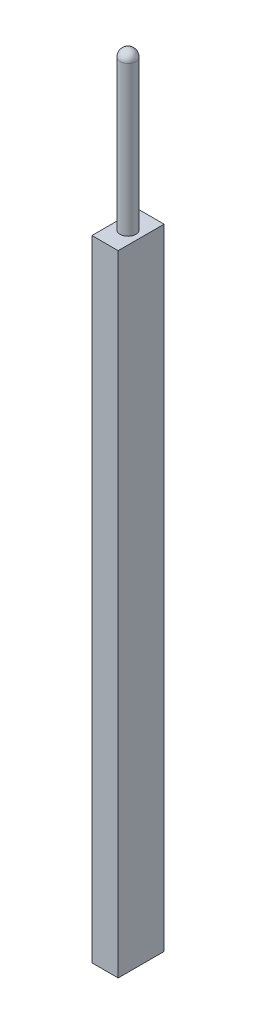
ISO-10303-21;
HEADER;
FILE_DESCRIPTION(('STEP AP214'),'2;1');
FILE_NAME('part.step','',(''),(''),'','','');
FILE_SCHEMA(('AUTOMOTIVE_DESIGN { 1 0 10303 214 1 1 1 1 }'));
ENDSEC;
DATA;
#1=APPLICATION_CONTEXT('core data for automotive mechanical design processes');
#2=APPLICATION_PROTOCOL_DEFINITION('international standard','automotive_design',2000,#1);
#3=PRODUCT_CONTEXT('',#1,'mechanical');
#4=PRODUCT('Part','Part','',(#3));
#5=PRODUCT_RELATED_PRODUCT_CATEGORY('part','',(#4));
#6=PRODUCT_DEFINITION_FORMATION('','',#4);
#7=PRODUCT_DEFINITION_CONTEXT('part definition',#1,'design');
#8=PRODUCT_DEFINITION('design','',#6,#7);
#9=PRODUCT_DEFINITION_SHAPE('','',#8);
#10=(LENGTH_UNIT() NAMED_UNIT(*) SI_UNIT(.MILLI.,.METRE.));
#11=(NAMED_UNIT(*) PLANE_ANGLE_UNIT() SI_UNIT($,.RADIAN.));
#12=(NAMED_UNIT(*) SI_UNIT($,.STERADIAN.) SOLID_ANGLE_UNIT());
#13=UNCERTAINTY_MEASURE_WITH_UNIT(LENGTH_MEASURE(1.E-05),#10,'distance_accuracy_value','');
#14=(GEOMETRIC_REPRESENTATION_CONTEXT(3) GLOBAL_UNCERTAINTY_ASSIGNED_CONTEXT((#13)) GLOBAL_UNIT_ASSIGNED_CONTEXT((#10,
#11,#12)) REPRESENTATION_CONTEXT('',''));
#15=CARTESIAN_POINT('',(0.,0.,0.));
#16=DIRECTION('',(0.,0.,1.));
#17=DIRECTION('',(1.,0.,0.));
#18=AXIS2_PLACEMENT_3D('',#15,#16,#17);
#19=CARTESIAN_POINT('',(0.,28.5,0.));
#20=DIRECTION('',(0.,-1.,0.));
#21=DIRECTION('',(1.,0.,0.));
#22=AXIS2_PLACEMENT_3D('',#19,#20,#21);
#23=SPHERICAL_SURFACE('',#22,1.5);
#24=CARTESIAN_POINT('',(0.,28.5,0.));
#25=DIRECTION('',(0.,-1.,0.));
#26=DIRECTION('',(0.,0.,-1.));
#27=AXIS2_PLACEMENT_3D('',#24,#25,#26);
#28=CIRCLE('',#27,1.5);
#29=CARTESIAN_POINT('',(0.,28.5,-1.5));
#30=VERTEX_POINT('',#29);
#31=EDGE_CURVE('E11',#30,#30,#28,.T.);
#32=ORIENTED_EDGE('',*,*,#31,.F.);
#33=EDGE_LOOP('',(#32));
#34=FACE_BOUND('',#33,.T.);
#35=ADVANCED_FACE('F39',(#34),#23,.T.);
#36=CARTESIAN_POINT('',(0.,0.,0.));
#37=DIRECTION('',(0.,-1.,0.));
#38=DIRECTION('',(0.,0.,-1.));
#39=AXIS2_PLACEMENT_3D('',#36,#37,#38);
#40=CYLINDRICAL_SURFACE('',#39,1.5);
#41=CARTESIAN_POINT('',(0.,0.,0.));
#42=DIRECTION('',(0.,-1.,0.));
#43=DIRECTION('',(0.,0.,-1.));
#44=AXIS2_PLACEMENT_3D('',#41,#42,#43);
#45=CIRCLE('',#44,1.5);
#46=CARTESIAN_POINT('',(0.,0.,-1.5));
#47=VERTEX_POINT('',#46);
#48=EDGE_CURVE('E47',#47,#47,#45,.T.);
#49=ORIENTED_EDGE('',*,*,#48,.F.);
#50=EDGE_LOOP('',(#49));
#51=FACE_BOUND('',#50,.T.);
#52=ORIENTED_EDGE('',*,*,#31,.T.);
#53=EDGE_LOOP('',(#52));
#54=FACE_BOUND('',#53,.T.);
#55=ADVANCED_FACE('F120',(#51,#54),#40,.T.);
#56=CARTESIAN_POINT('',(2.5,-120.,-4.375));
#57=DIRECTION('',(-1.,0.,0.));
#58=DIRECTION('',(0.,0.,1.));
#59=AXIS2_PLACEMENT_3D('',#56,#57,#58);
#60=PLANE('',#59);
#61=DIRECTION('',(0.,0.,1.));
#62=VECTOR('',#61,1.);
#63=CARTESIAN_POINT('',(2.5,0.,-4.375));
#64=LINE('',#63,#62);
#65=CARTESIAN_POINT('',(2.5,0.,-4.375));
#66=VERTEX_POINT('',#65);
#67=CARTESIAN_POINT('',(2.5,0.,4.375));
#68=VERTEX_POINT('',#67);
#69=EDGE_CURVE('E106',#66,#68,#64,.T.);
#70=ORIENTED_EDGE('',*,*,#69,.T.);
#71=DIRECTION('',(0.,1.,0.));
#72=VECTOR('',#71,1.);
#73=CARTESIAN_POINT('',(2.5,-120.,4.375));
#74=LINE('',#73,#72);
#75=CARTESIAN_POINT('',(2.5,-120.,4.375));
#76=VERTEX_POINT('',#75);
#77=EDGE_CURVE('E97',#76,#68,#74,.T.);
#78=ORIENTED_EDGE('',*,*,#77,.F.);
#79=DIRECTION('',(0.,0.,1.));
#80=VECTOR('',#79,1.);
#81=CARTESIAN_POINT('',(2.5,-120.,-4.375));
#82=LINE('',#81,#80);
#83=CARTESIAN_POINT('',(2.5,-120.,-4.375));
#84=VERTEX_POINT('',#83);
#85=EDGE_CURVE('E91',#84,#76,#82,.T.);
#86=ORIENTED_EDGE('',*,*,#85,.F.);
#87=DIRECTION('',(0.,1.,0.));
#88=VECTOR('',#87,1.);
#89=CARTESIAN_POINT('',(2.5,-120.,-4.375));
#90=LINE('',#89,#88);
#91=EDGE_CURVE('E102',#84,#66,#90,.T.);
#92=ORIENTED_EDGE('',*,*,#91,.T.);
#93=EDGE_LOOP('',(#70,#78,#86,#92));
#94=FACE_BOUND('',#93,.T.);
#95=ADVANCED_FACE('F123',(#94),#60,.F.);
#96=CARTESIAN_POINT('',(-2.5,-120.,4.375));
#97=DIRECTION('',(0.,0.,-1.));
#98=DIRECTION('',(-1.,0.,0.));
#99=AXIS2_PLACEMENT_3D('',#96,#97,#98);
#100=PLANE('',#99);
#101=DIRECTION('',(-1.,0.,0.));
#102=VECTOR('',#101,1.);
#103=CARTESIAN_POINT('',(-2.5,0.,4.375));
#104=LINE('',#103,#102);
#105=CARTESIAN_POINT('',(-2.5,0.,4.375));
#106=VERTEX_POINT('',#105);
#107=EDGE_CURVE('E96',#68,#106,#104,.T.);
#108=ORIENTED_EDGE('',*,*,#107,.T.);
#109=DIRECTION('',(0.,1.,0.));
#110=VECTOR('',#109,1.);
#111=CARTESIAN_POINT('',(-2.5,-120.,4.375));
#112=LINE('',#111,#110);
#113=CARTESIAN_POINT('',(-2.5,-120.,4.375));
#114=VERTEX_POINT('',#113);
#115=EDGE_CURVE('E94',#114,#106,#112,.T.);
#116=ORIENTED_EDGE('',*,*,#115,.F.);
#117=DIRECTION('',(-1.,0.,0.));
#118=VECTOR('',#117,1.);
#119=CARTESIAN_POINT('',(-2.5,-120.,4.375));
#120=LINE('',#119,#118);
#121=EDGE_CURVE('E86',#76,#114,#120,.T.);
#122=ORIENTED_EDGE('',*,*,#121,.F.);
#123=ORIENTED_EDGE('',*,*,#77,.T.);
#124=EDGE_LOOP('',(#108,#116,#122,#123));
#125=FACE_BOUND('',#124,.T.);
#126=ADVANCED_FACE('F95',(#125),#100,.F.);
#127=CARTESIAN_POINT('',(-2.5,-120.,-4.375));
#128=DIRECTION('',(1.,0.,0.));
#129=DIRECTION('',(0.,0.,-1.));
#130=AXIS2_PLACEMENT_3D('',#127,#128,#129);
#131=PLANE('',#130);
#132=DIRECTION('',(0.,0.,-1.));
#133=VECTOR('',#132,1.);
#134=CARTESIAN_POINT('',(-2.5,0.,-4.375));
#135=LINE('',#134,#133);
#136=CARTESIAN_POINT('',(-2.5,0.,-4.375));
#137=VERTEX_POINT('',#136);
#138=EDGE_CURVE('E72',#106,#137,#135,.T.);
#139=ORIENTED_EDGE('',*,*,#138,.T.);
#140=DIRECTION('',(0.,1.,0.));
#141=VECTOR('',#140,1.);
#142=CARTESIAN_POINT('',(-2.5,-120.,-4.375));
#143=LINE('',#142,#141);
#144=CARTESIAN_POINT('',(-2.5,-120.,-4.375));
#145=VERTEX_POINT('',#144);
#146=EDGE_CURVE('E98',#145,#137,#143,.T.);
#147=ORIENTED_EDGE('',*,*,#146,.F.);
#148=DIRECTION('',(0.,0.,-1.));
#149=VECTOR('',#148,1.);
#150=CARTESIAN_POINT('',(-2.5,-120.,-4.375));
#151=LINE('',#150,#149);
#152=EDGE_CURVE('E89',#114,#145,#151,.T.);
#153=ORIENTED_EDGE('',*,*,#152,.F.);
#154=ORIENTED_EDGE('',*,*,#115,.T.);
#155=EDGE_LOOP('',(#139,#147,#153,#154));
#156=FACE_BOUND('',#155,.T.);
#157=ADVANCED_FACE('F100',(#156),#131,.F.);
#158=CARTESIAN_POINT('',(-2.5,-120.,-4.375));
#159=DIRECTION('',(0.,0.,1.));
#160=DIRECTION('',(1.,0.,0.));
#161=AXIS2_PLACEMENT_3D('',#158,#159,#160);
#162=PLANE('',#161);
#163=DIRECTION('',(1.,0.,0.));
#164=VECTOR('',#163,1.);
#165=CARTESIAN_POINT('',(-2.5,0.,-4.375));
#166=LINE('',#165,#164);
#167=EDGE_CURVE('E78',#137,#66,#166,.T.);
#168=ORIENTED_EDGE('',*,*,#167,.T.);
#169=ORIENTED_EDGE('',*,*,#91,.F.);
#170=DIRECTION('',(1.,0.,0.));
#171=VECTOR('',#170,1.);
#172=CARTESIAN_POINT('',(-2.5,-120.,-4.375));
#173=LINE('',#172,#171);
#174=EDGE_CURVE('E55',#145,#84,#173,.T.);
#175=ORIENTED_EDGE('',*,*,#174,.F.);
#176=ORIENTED_EDGE('',*,*,#146,.T.);
#177=EDGE_LOOP('',(#168,#169,#175,#176));
#178=FACE_BOUND('',#177,.T.);
#179=ADVANCED_FACE('F154',(#178),#162,.F.);
#180=CARTESIAN_POINT('',(0.,-120.,0.));
#181=DIRECTION('',(0.,1.,0.));
#182=DIRECTION('',(0.,0.,1.));
#183=AXIS2_PLACEMENT_3D('',#180,#181,#182);
#184=PLANE('',#183);
#185=ORIENTED_EDGE('',*,*,#85,.T.);
#186=ORIENTED_EDGE('',*,*,#121,.T.);
#187=ORIENTED_EDGE('',*,*,#152,.T.);
#188=ORIENTED_EDGE('',*,*,#174,.T.);
#189=EDGE_LOOP('',(#185,#186,#187,#188));
#190=FACE_BOUND('',#189,.T.);
#191=ADVANCED_FACE('F87',(#190),#184,.F.);
#192=CARTESIAN_POINT('',(0.,0.,0.));
#193=DIRECTION('',(0.,1.,0.));
#194=DIRECTION('',(0.,0.,1.));
#195=AXIS2_PLACEMENT_3D('',#192,#193,#194);
#196=PLANE('',#195);
#197=ORIENTED_EDGE('',*,*,#48,.T.);
#198=EDGE_LOOP('',(#197));
#199=FACE_BOUND('',#198,.T.);
#200=ORIENTED_EDGE('',*,*,#69,.F.);
#201=ORIENTED_EDGE('',*,*,#167,.F.);
#202=ORIENTED_EDGE('',*,*,#138,.F.);
#203=ORIENTED_EDGE('',*,*,#107,.F.);
#204=EDGE_LOOP('',(#200,#201,#202,#203));
#205=FACE_BOUND('',#204,.T.);
#206=ADVANCED_FACE('F117',(#199,#205),#196,.T.);
#207=CLOSED_SHELL('',(#35,#55,#95,#126,#157,#179,#191,#206));
#208=MANIFOLD_SOLID_BREP('B2',#207);
#209=ADVANCED_BREP_SHAPE_REPRESENTATION('',(#18,#208),#14);
#210=SHAPE_DEFINITION_REPRESENTATION(#9,#209);
ENDSEC;
END-ISO-10303-21;
